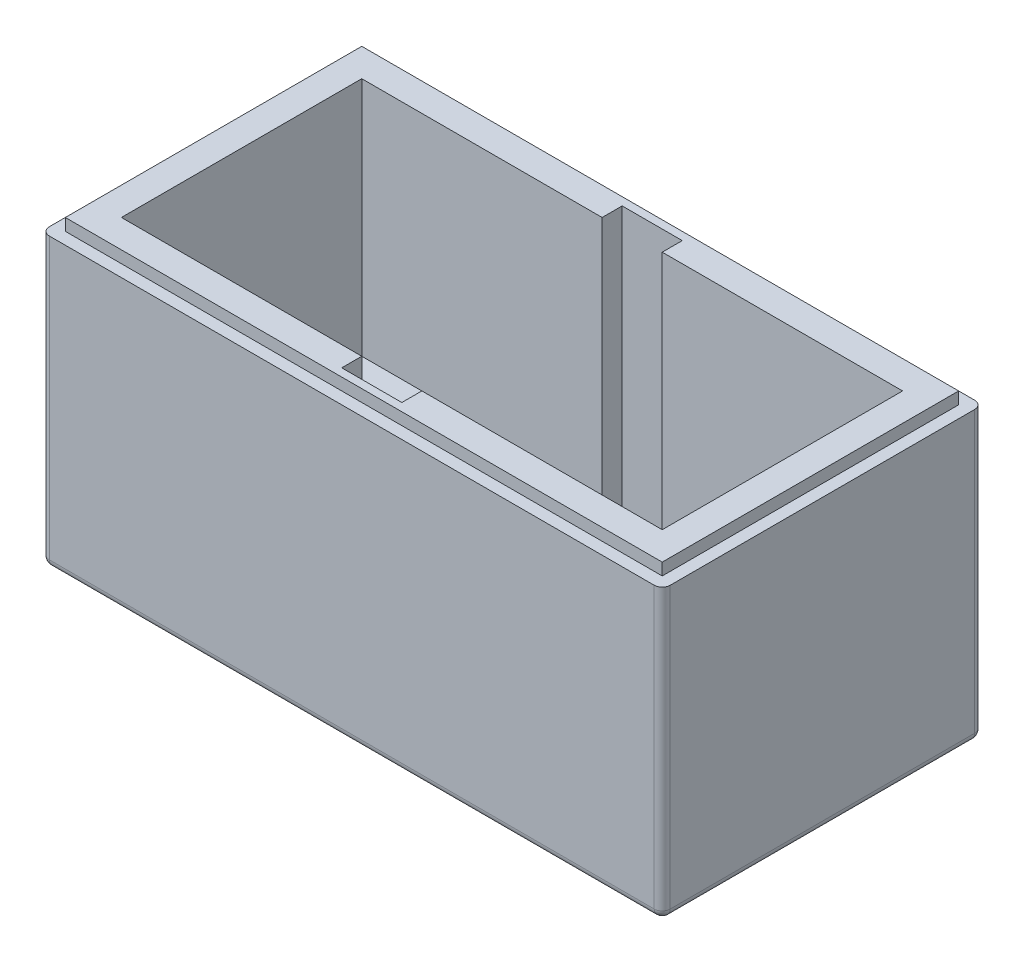
ISO-10303-21;
HEADER;
FILE_DESCRIPTION(('STEP AP214'),'2;1');
FILE_NAME('part.step','',(''),(''),'','','');
FILE_SCHEMA(('AUTOMOTIVE_DESIGN { 1 0 10303 214 1 1 1 1 }'));
ENDSEC;
DATA;
#1=APPLICATION_CONTEXT('core data for automotive mechanical design processes');
#2=APPLICATION_PROTOCOL_DEFINITION('international standard','automotive_design',2000,#1);
#3=PRODUCT_CONTEXT('',#1,'mechanical');
#4=PRODUCT('Part','Part','',(#3));
#5=PRODUCT_RELATED_PRODUCT_CATEGORY('part','',(#4));
#6=PRODUCT_DEFINITION_FORMATION('','',#4);
#7=PRODUCT_DEFINITION_CONTEXT('part definition',#1,'design');
#8=PRODUCT_DEFINITION('design','',#6,#7);
#9=PRODUCT_DEFINITION_SHAPE('','',#8);
#10=(LENGTH_UNIT() NAMED_UNIT(*) SI_UNIT(.MILLI.,.METRE.));
#11=(NAMED_UNIT(*) PLANE_ANGLE_UNIT() SI_UNIT($,.RADIAN.));
#12=(NAMED_UNIT(*) SI_UNIT($,.STERADIAN.) SOLID_ANGLE_UNIT());
#13=UNCERTAINTY_MEASURE_WITH_UNIT(LENGTH_MEASURE(1.E-05),#10,'distance_accuracy_value','');
#14=(GEOMETRIC_REPRESENTATION_CONTEXT(3) GLOBAL_UNCERTAINTY_ASSIGNED_CONTEXT((#13)) GLOBAL_UNIT_ASSIGNED_CONTEXT((#10,
#11,#12)) REPRESENTATION_CONTEXT('',''));
#15=CARTESIAN_POINT('',(0.,0.,0.));
#16=DIRECTION('',(0.,0.,1.));
#17=DIRECTION('',(1.,0.,0.));
#18=AXIS2_PLACEMENT_3D('',#15,#16,#17);
#19=CARTESIAN_POINT('',(0.,75.,0.));
#20=DIRECTION('',(0.,1.,0.));
#21=DIRECTION('',(0.,0.,1.));
#22=AXIS2_PLACEMENT_3D('',#19,#20,#21);
#23=PLANE('',#22);
#24=DIRECTION('',(0.,0.,1.));
#25=VECTOR('',#24,1.);
#26=CARTESIAN_POINT('',(-145.,75.,10.));
#27=LINE('',#26,#25);
#28=CARTESIAN_POINT('',(-145.,75.,10.));
#29=VERTEX_POINT('',#28);
#30=CARTESIAN_POINT('',(-145.,75.,70.));
#31=VERTEX_POINT('',#30);
#32=EDGE_CURVE('E267',#29,#31,#27,.T.);
#33=ORIENTED_EDGE('',*,*,#32,.F.);
#34=DIRECTION('',(-1.,0.,0.));
#35=VECTOR('',#34,1.);
#36=CARTESIAN_POINT('',(-145.,75.,10.));
#37=LINE('',#36,#35);
#38=CARTESIAN_POINT('',(-85.,75.,10.));
#39=VERTEX_POINT('',#38);
#40=EDGE_CURVE('E265',#39,#29,#37,.T.);
#41=ORIENTED_EDGE('',*,*,#40,.F.);
#42=DIRECTION('',(0.,0.,1.));
#43=VECTOR('',#42,1.);
#44=CARTESIAN_POINT('',(-85.,75.,10.));
#45=LINE('',#44,#43);
#46=CARTESIAN_POINT('',(-85.,75.,5.00000000000001));
#47=VERTEX_POINT('',#46);
#48=EDGE_CURVE('E292',#47,#39,#45,.T.);
#49=ORIENTED_EDGE('',*,*,#48,.F.);
#50=DIRECTION('',(-1.,0.,0.));
#51=VECTOR('',#50,1.);
#52=CARTESIAN_POINT('',(-85.,75.,5.00000000000001));
#53=LINE('',#52,#51);
#54=CARTESIAN_POINT('',(-70.,75.,5.00000000000001));
#55=VERTEX_POINT('',#54);
#56=EDGE_CURVE('E289',#55,#47,#53,.T.);
#57=ORIENTED_EDGE('',*,*,#56,.F.);
#58=DIRECTION('',(0.,0.,-1.));
#59=VECTOR('',#58,1.);
#60=CARTESIAN_POINT('',(-70.,75.,5.00000000000001));
#61=LINE('',#60,#59);
#62=CARTESIAN_POINT('',(-70.,75.,9.99999999999999));
#63=VERTEX_POINT('',#62);
#64=EDGE_CURVE('E286',#63,#55,#61,.T.);
#65=ORIENTED_EDGE('',*,*,#64,.F.);
#66=DIRECTION('',(-1.,0.,0.));
#67=VECTOR('',#66,1.);
#68=CARTESIAN_POINT('',(-70.,75.,9.99999999999999));
#69=LINE('',#68,#67);
#70=CARTESIAN_POINT('',(-9.99999999999999,75.,10.));
#71=VERTEX_POINT('',#70);
#72=EDGE_CURVE('E284',#71,#63,#69,.T.);
#73=ORIENTED_EDGE('',*,*,#72,.F.);
#74=DIRECTION('',(0.,0.,-1.));
#75=VECTOR('',#74,1.);
#76=CARTESIAN_POINT('',(-9.99999999999999,75.,10.));
#77=LINE('',#76,#75);
#78=CARTESIAN_POINT('',(-9.99999999999999,75.,70.));
#79=VERTEX_POINT('',#78);
#80=EDGE_CURVE('E282',#79,#71,#77,.T.);
#81=ORIENTED_EDGE('',*,*,#80,.F.);
#82=DIRECTION('',(1.,0.,0.));
#83=VECTOR('',#82,1.);
#84=CARTESIAN_POINT('',(-9.99999999999999,75.,70.));
#85=LINE('',#84,#83);
#86=CARTESIAN_POINT('',(-70.,75.,70.));
#87=VERTEX_POINT('',#86);
#88=EDGE_CURVE('E280',#87,#79,#85,.T.);
#89=ORIENTED_EDGE('',*,*,#88,.F.);
#90=DIRECTION('',(0.,0.,-1.));
#91=VECTOR('',#90,1.);
#92=CARTESIAN_POINT('',(-70.,75.,70.));
#93=LINE('',#92,#91);
#94=CARTESIAN_POINT('',(-70.,75.,75.));
#95=VERTEX_POINT('',#94);
#96=EDGE_CURVE('E278',#95,#87,#93,.T.);
#97=ORIENTED_EDGE('',*,*,#96,.F.);
#98=DIRECTION('',(1.,0.,0.));
#99=VECTOR('',#98,1.);
#100=CARTESIAN_POINT('',(-85.,75.,75.));
#101=LINE('',#100,#99);
#102=CARTESIAN_POINT('',(-85.,75.,75.));
#103=VERTEX_POINT('',#102);
#104=EDGE_CURVE('E275',#103,#95,#101,.T.);
#105=ORIENTED_EDGE('',*,*,#104,.F.);
#106=DIRECTION('',(0.,0.,1.));
#107=VECTOR('',#106,1.);
#108=CARTESIAN_POINT('',(-85.,75.,70.));
#109=LINE('',#108,#107);
#110=CARTESIAN_POINT('',(-85.,75.,70.));
#111=VERTEX_POINT('',#110);
#112=EDGE_CURVE('E272',#111,#103,#109,.T.);
#113=ORIENTED_EDGE('',*,*,#112,.F.);
#114=DIRECTION('',(1.,0.,0.));
#115=VECTOR('',#114,1.);
#116=CARTESIAN_POINT('',(-145.,75.,70.));
#117=LINE('',#116,#115);
#118=EDGE_CURVE('E270',#31,#111,#117,.T.);
#119=ORIENTED_EDGE('',*,*,#118,.F.);
#120=EDGE_LOOP('',(#33,#41,#49,#57,#65,#73,#81,#89,#97,#105,#113,#119));
#121=FACE_BOUND('',#120,.T.);
#122=DIRECTION('',(-1.,0.,0.));
#123=VECTOR('',#122,1.);
#124=CARTESIAN_POINT('',(-152.,75.,3.));
#125=LINE('',#124,#123);
#126=CARTESIAN_POINT('',(-3.,75.,3.));
#127=VERTEX_POINT('',#126);
#128=CARTESIAN_POINT('',(-152.,75.,3.));
#129=VERTEX_POINT('',#128);
#130=EDGE_CURVE('E235',#127,#129,#125,.T.);
#131=ORIENTED_EDGE('',*,*,#130,.T.);
#132=DIRECTION('',(0.,0.,1.));
#133=VECTOR('',#132,1.);
#134=CARTESIAN_POINT('',(-152.,75.,3.));
#135=LINE('',#134,#133);
#136=CARTESIAN_POINT('',(-152.,75.,77.));
#137=VERTEX_POINT('',#136);
#138=EDGE_CURVE('E243',#129,#137,#135,.T.);
#139=ORIENTED_EDGE('',*,*,#138,.T.);
#140=DIRECTION('',(1.,0.,0.));
#141=VECTOR('',#140,1.);
#142=CARTESIAN_POINT('',(-152.,75.,77.));
#143=LINE('',#142,#141);
#144=CARTESIAN_POINT('',(-3.,75.,77.));
#145=VERTEX_POINT('',#144);
#146=EDGE_CURVE('E214',#137,#145,#143,.T.);
#147=ORIENTED_EDGE('',*,*,#146,.T.);
#148=DIRECTION('',(0.,0.,-1.));
#149=VECTOR('',#148,1.);
#150=CARTESIAN_POINT('',(-3.,75.,3.));
#151=LINE('',#150,#149);
#152=EDGE_CURVE('E238',#145,#127,#151,.T.);
#153=ORIENTED_EDGE('',*,*,#152,.T.);
#154=EDGE_LOOP('',(#131,#139,#147,#153));
#155=FACE_BOUND('',#154,.T.);
#156=ADVANCED_FACE('F36',(#121,#155),#23,.T.);
#157=CARTESIAN_POINT('',(0.,15.,0.));
#158=DIRECTION('',(0.,-1.,0.));
#159=DIRECTION('',(0.,0.,-1.));
#160=AXIS2_PLACEMENT_3D('',#157,#158,#159);
#161=PLANE('',#160);
#162=DIRECTION('',(0.,0.,1.));
#163=VECTOR('',#162,1.);
#164=CARTESIAN_POINT('',(-85.,15.,5.00000000000001));
#165=LINE('',#164,#163);
#166=CARTESIAN_POINT('',(-85.,15.,10.));
#167=VERTEX_POINT('',#166);
#168=CARTESIAN_POINT('',(-85.,15.,70.));
#169=VERTEX_POINT('',#168);
#170=EDGE_CURVE('E328',#167,#169,#165,.T.);
#171=ORIENTED_EDGE('',*,*,#170,.F.);
#172=DIRECTION('',(-1.,0.,0.));
#173=VECTOR('',#172,1.);
#174=CARTESIAN_POINT('',(-145.,15.,10.));
#175=LINE('',#174,#173);
#176=CARTESIAN_POINT('',(-145.,15.,10.));
#177=VERTEX_POINT('',#176);
#178=EDGE_CURVE('E264',#167,#177,#175,.T.);
#179=ORIENTED_EDGE('',*,*,#178,.T.);
#180=DIRECTION('',(0.,0.,1.));
#181=VECTOR('',#180,1.);
#182=CARTESIAN_POINT('',(-145.,15.,10.));
#183=LINE('',#182,#181);
#184=CARTESIAN_POINT('',(-145.,15.,70.));
#185=VERTEX_POINT('',#184);
#186=EDGE_CURVE('E297',#177,#185,#183,.T.);
#187=ORIENTED_EDGE('',*,*,#186,.T.);
#188=DIRECTION('',(1.,0.,0.));
#189=VECTOR('',#188,1.);
#190=CARTESIAN_POINT('',(-145.,15.,70.));
#191=LINE('',#190,#189);
#192=EDGE_CURVE('E300',#185,#169,#191,.T.);
#193=ORIENTED_EDGE('',*,*,#192,.T.);
#194=EDGE_LOOP('',(#171,#179,#187,#193));
#195=FACE_BOUND('',#194,.T.);
#196=ADVANCED_FACE('F496',(#195),#161,.F.);
#197=DIRECTION('',(0.,0.,-1.));
#198=VECTOR('',#197,1.);
#199=CARTESIAN_POINT('',(-70.,15.,5.00000000000001));
#200=LINE('',#199,#198);
#201=CARTESIAN_POINT('',(-70.,15.,70.));
#202=VERTEX_POINT('',#201);
#203=CARTESIAN_POINT('',(-70.,15.,10.));
#204=VERTEX_POINT('',#203);
#205=EDGE_CURVE('E333',#202,#204,#200,.T.);
#206=ORIENTED_EDGE('',*,*,#205,.F.);
#207=DIRECTION('',(1.,0.,0.));
#208=VECTOR('',#207,1.);
#209=CARTESIAN_POINT('',(-9.99999999999999,15.,70.));
#210=LINE('',#209,#208);
#211=CARTESIAN_POINT('',(-9.99999999999999,15.,70.));
#212=VERTEX_POINT('',#211);
#213=EDGE_CURVE('E303',#202,#212,#210,.T.);
#214=ORIENTED_EDGE('',*,*,#213,.T.);
#215=DIRECTION('',(0.,0.,-1.));
#216=VECTOR('',#215,1.);
#217=CARTESIAN_POINT('',(-9.99999999999999,15.,10.));
#218=LINE('',#217,#216);
#219=CARTESIAN_POINT('',(-9.99999999999999,15.,10.));
#220=VERTEX_POINT('',#219);
#221=EDGE_CURVE('E306',#212,#220,#218,.T.);
#222=ORIENTED_EDGE('',*,*,#221,.T.);
#223=DIRECTION('',(-1.,0.,0.));
#224=VECTOR('',#223,1.);
#225=CARTESIAN_POINT('',(-70.,15.,9.99999999999999));
#226=LINE('',#225,#224);
#227=EDGE_CURVE('E268',#220,#204,#226,.T.);
#228=ORIENTED_EDGE('',*,*,#227,.T.);
#229=EDGE_LOOP('',(#206,#214,#222,#228));
#230=FACE_BOUND('',#229,.T.);
#231=ADVANCED_FACE('F502',(#230),#161,.F.);
#232=CARTESIAN_POINT('',(-85.,10.,5.00000000000001));
#233=DIRECTION('',(-1.,0.,0.));
#234=DIRECTION('',(0.,0.,1.));
#235=AXIS2_PLACEMENT_3D('',#232,#233,#234);
#236=PLANE('',#235);
#237=DIRECTION('',(0.,1.,0.));
#238=VECTOR('',#237,1.);
#239=CARTESIAN_POINT('',(-85.,10.,5.00000000000001));
#240=LINE('',#239,#238);
#241=CARTESIAN_POINT('',(-85.,10.,5.00000000000001));
#242=VERTEX_POINT('',#241);
#243=EDGE_CURVE('E347',#242,#47,#240,.T.);
#244=ORIENTED_EDGE('',*,*,#243,.T.);
#245=ORIENTED_EDGE('',*,*,#48,.T.);
#246=DIRECTION('',(0.,-1.,0.));
#247=VECTOR('',#246,1.);
#248=CARTESIAN_POINT('',(-85.,75.,10.));
#249=LINE('',#248,#247);
#250=EDGE_CURVE('E294',#39,#167,#249,.T.);
#251=ORIENTED_EDGE('',*,*,#250,.T.);
#252=ORIENTED_EDGE('',*,*,#170,.T.);
#253=DIRECTION('',(0.,-1.,0.));
#254=VECTOR('',#253,1.);
#255=CARTESIAN_POINT('',(-85.,75.,70.));
#256=LINE('',#255,#254);
#257=EDGE_CURVE('E321',#111,#169,#256,.T.);
#258=ORIENTED_EDGE('',*,*,#257,.F.);
#259=ORIENTED_EDGE('',*,*,#112,.T.);
#260=DIRECTION('',(0.,1.,0.));
#261=VECTOR('',#260,1.);
#262=CARTESIAN_POINT('',(-85.,10.,75.));
#263=LINE('',#262,#261);
#264=CARTESIAN_POINT('',(-85.,10.,75.));
#265=VERTEX_POINT('',#264);
#266=EDGE_CURVE('E342',#265,#103,#263,.T.);
#267=ORIENTED_EDGE('',*,*,#266,.F.);
#268=DIRECTION('',(0.,0.,1.));
#269=VECTOR('',#268,1.);
#270=CARTESIAN_POINT('',(-85.,10.,5.00000000000001));
#271=LINE('',#270,#269);
#272=EDGE_CURVE('E329',#242,#265,#271,.T.);
#273=ORIENTED_EDGE('',*,*,#272,.F.);
#274=EDGE_LOOP('',(#244,#245,#251,#252,#258,#259,#267,#273));
#275=FACE_BOUND('',#274,.T.);
#276=ADVANCED_FACE('F520',(#275),#236,.F.);
#277=CARTESIAN_POINT('',(-85.,10.,5.00000000000001));
#278=DIRECTION('',(0.,0.,-1.));
#279=DIRECTION('',(-1.,0.,0.));
#280=AXIS2_PLACEMENT_3D('',#277,#278,#279);
#281=PLANE('',#280);
#282=DIRECTION('',(0.,1.,0.));
#283=VECTOR('',#282,1.);
#284=CARTESIAN_POINT('',(-70.,10.,5.00000000000001));
#285=LINE('',#284,#283);
#286=CARTESIAN_POINT('',(-70.,10.,5.00000000000001));
#287=VERTEX_POINT('',#286);
#288=EDGE_CURVE('E350',#287,#55,#285,.T.);
#289=ORIENTED_EDGE('',*,*,#288,.T.);
#290=ORIENTED_EDGE('',*,*,#56,.T.);
#291=ORIENTED_EDGE('',*,*,#243,.F.);
#292=DIRECTION('',(-1.,0.,0.));
#293=VECTOR('',#292,1.);
#294=CARTESIAN_POINT('',(-85.,10.,5.00000000000001));
#295=LINE('',#294,#293);
#296=EDGE_CURVE('E339',#287,#242,#295,.T.);
#297=ORIENTED_EDGE('',*,*,#296,.F.);
#298=EDGE_LOOP('',(#289,#290,#291,#297));
#299=FACE_BOUND('',#298,.T.);
#300=ADVANCED_FACE('F516',(#299),#281,.F.);
#301=CARTESIAN_POINT('',(-70.,10.,5.00000000000001));
#302=DIRECTION('',(1.,0.,0.));
#303=DIRECTION('',(0.,0.,-1.));
#304=AXIS2_PLACEMENT_3D('',#301,#302,#303);
#305=PLANE('',#304);
#306=DIRECTION('',(0.,1.,0.));
#307=VECTOR('',#306,1.);
#308=CARTESIAN_POINT('',(-70.,10.,75.));
#309=LINE('',#308,#307);
#310=CARTESIAN_POINT('',(-70.,10.,75.));
#311=VERTEX_POINT('',#310);
#312=EDGE_CURVE('E352',#311,#95,#309,.T.);
#313=ORIENTED_EDGE('',*,*,#312,.T.);
#314=ORIENTED_EDGE('',*,*,#96,.T.);
#315=DIRECTION('',(0.,-1.,0.));
#316=VECTOR('',#315,1.);
#317=CARTESIAN_POINT('',(-70.,75.,70.));
#318=LINE('',#317,#316);
#319=EDGE_CURVE('E319',#87,#202,#318,.T.);
#320=ORIENTED_EDGE('',*,*,#319,.T.);
#321=ORIENTED_EDGE('',*,*,#205,.T.);
#322=DIRECTION('',(0.,-1.,0.));
#323=VECTOR('',#322,1.);
#324=CARTESIAN_POINT('',(-70.,75.,9.99999999999999));
#325=LINE('',#324,#323);
#326=EDGE_CURVE('E313',#63,#204,#325,.T.);
#327=ORIENTED_EDGE('',*,*,#326,.F.);
#328=ORIENTED_EDGE('',*,*,#64,.T.);
#329=ORIENTED_EDGE('',*,*,#288,.F.);
#330=DIRECTION('',(0.,0.,-1.));
#331=VECTOR('',#330,1.);
#332=CARTESIAN_POINT('',(-70.,10.,5.00000000000001));
#333=LINE('',#332,#331);
#334=EDGE_CURVE('E336',#311,#287,#333,.T.);
#335=ORIENTED_EDGE('',*,*,#334,.F.);
#336=EDGE_LOOP('',(#313,#314,#320,#321,#327,#328,#329,#335));
#337=FACE_BOUND('',#336,.T.);
#338=ADVANCED_FACE('F519',(#337),#305,.F.);
#339=CARTESIAN_POINT('',(-85.,10.,75.));
#340=DIRECTION('',(0.,0.,1.));
#341=DIRECTION('',(1.,0.,0.));
#342=AXIS2_PLACEMENT_3D('',#339,#340,#341);
#343=PLANE('',#342);
#344=ORIENTED_EDGE('',*,*,#266,.T.);
#345=ORIENTED_EDGE('',*,*,#104,.T.);
#346=ORIENTED_EDGE('',*,*,#312,.F.);
#347=DIRECTION('',(1.,0.,0.));
#348=VECTOR('',#347,1.);
#349=CARTESIAN_POINT('',(-85.,10.,75.));
#350=LINE('',#349,#348);
#351=EDGE_CURVE('E332',#265,#311,#350,.T.);
#352=ORIENTED_EDGE('',*,*,#351,.F.);
#353=EDGE_LOOP('',(#344,#345,#346,#352));
#354=FACE_BOUND('',#353,.T.);
#355=ADVANCED_FACE('F514',(#354),#343,.F.);
#356=CARTESIAN_POINT('',(0.,10.,0.));
#357=DIRECTION('',(0.,1.,0.));
#358=DIRECTION('',(0.,0.,1.));
#359=AXIS2_PLACEMENT_3D('',#356,#357,#358);
#360=PLANE('',#359);
#361=ORIENTED_EDGE('',*,*,#272,.T.);
#362=ORIENTED_EDGE('',*,*,#351,.T.);
#363=ORIENTED_EDGE('',*,*,#334,.T.);
#364=ORIENTED_EDGE('',*,*,#296,.T.);
#365=EDGE_LOOP('',(#361,#362,#363,#364));
#366=FACE_BOUND('',#365,.T.);
#367=ADVANCED_FACE('F511',(#366),#360,.T.);
#368=CARTESIAN_POINT('',(-145.,75.,10.));
#369=DIRECTION('',(0.,0.,1.));
#370=DIRECTION('',(1.,0.,0.));
#371=AXIS2_PLACEMENT_3D('',#368,#369,#370);
#372=PLANE('',#371);
#373=ORIENTED_EDGE('',*,*,#178,.F.);
#374=ORIENTED_EDGE('',*,*,#250,.F.);
#375=ORIENTED_EDGE('',*,*,#40,.T.);
#376=DIRECTION('',(0.,-1.,0.));
#377=VECTOR('',#376,1.);
#378=CARTESIAN_POINT('',(-145.,75.,10.));
#379=LINE('',#378,#377);
#380=EDGE_CURVE('E325',#29,#177,#379,.T.);
#381=ORIENTED_EDGE('',*,*,#380,.T.);
#382=EDGE_LOOP('',(#373,#374,#375,#381));
#383=FACE_BOUND('',#382,.T.);
#384=ADVANCED_FACE('F509',(#383),#372,.T.);
#385=CARTESIAN_POINT('',(-145.,75.,10.));
#386=DIRECTION('',(1.,0.,0.));
#387=DIRECTION('',(0.,0.,-1.));
#388=AXIS2_PLACEMENT_3D('',#385,#386,#387);
#389=PLANE('',#388);
#390=ORIENTED_EDGE('',*,*,#186,.F.);
#391=ORIENTED_EDGE('',*,*,#380,.F.);
#392=ORIENTED_EDGE('',*,*,#32,.T.);
#393=DIRECTION('',(0.,-1.,0.));
#394=VECTOR('',#393,1.);
#395=CARTESIAN_POINT('',(-145.,75.,70.));
#396=LINE('',#395,#394);
#397=EDGE_CURVE('E323',#31,#185,#396,.T.);
#398=ORIENTED_EDGE('',*,*,#397,.T.);
#399=EDGE_LOOP('',(#390,#391,#392,#398));
#400=FACE_BOUND('',#399,.T.);
#401=ADVANCED_FACE('F746',(#400),#389,.T.);
#402=CARTESIAN_POINT('',(-145.,75.,70.));
#403=DIRECTION('',(0.,0.,-1.));
#404=DIRECTION('',(-1.,0.,0.));
#405=AXIS2_PLACEMENT_3D('',#402,#403,#404);
#406=PLANE('',#405);
#407=ORIENTED_EDGE('',*,*,#192,.F.);
#408=ORIENTED_EDGE('',*,*,#397,.F.);
#409=ORIENTED_EDGE('',*,*,#118,.T.);
#410=ORIENTED_EDGE('',*,*,#257,.T.);
#411=EDGE_LOOP('',(#407,#408,#409,#410));
#412=FACE_BOUND('',#411,.T.);
#413=ADVANCED_FACE('F738',(#412),#406,.T.);
#414=CARTESIAN_POINT('',(-9.99999999999999,75.,70.));
#415=DIRECTION('',(0.,0.,-1.));
#416=DIRECTION('',(-1.,0.,0.));
#417=AXIS2_PLACEMENT_3D('',#414,#415,#416);
#418=PLANE('',#417);
#419=ORIENTED_EDGE('',*,*,#213,.F.);
#420=ORIENTED_EDGE('',*,*,#319,.F.);
#421=ORIENTED_EDGE('',*,*,#88,.T.);
#422=DIRECTION('',(0.,-1.,0.));
#423=VECTOR('',#422,1.);
#424=CARTESIAN_POINT('',(-9.99999999999999,75.,70.));
#425=LINE('',#424,#423);
#426=EDGE_CURVE('E317',#79,#212,#425,.T.);
#427=ORIENTED_EDGE('',*,*,#426,.T.);
#428=EDGE_LOOP('',(#419,#420,#421,#427));
#429=FACE_BOUND('',#428,.T.);
#430=ADVANCED_FACE('F730',(#429),#418,.T.);
#431=CARTESIAN_POINT('',(-9.99999999999999,75.,10.));
#432=DIRECTION('',(-1.,0.,0.));
#433=DIRECTION('',(0.,0.,1.));
#434=AXIS2_PLACEMENT_3D('',#431,#432,#433);
#435=PLANE('',#434);
#436=ORIENTED_EDGE('',*,*,#221,.F.);
#437=ORIENTED_EDGE('',*,*,#426,.F.);
#438=ORIENTED_EDGE('',*,*,#80,.T.);
#439=DIRECTION('',(0.,-1.,0.));
#440=VECTOR('',#439,1.);
#441=CARTESIAN_POINT('',(-9.99999999999999,75.,10.));
#442=LINE('',#441,#440);
#443=EDGE_CURVE('E315',#71,#220,#442,.T.);
#444=ORIENTED_EDGE('',*,*,#443,.T.);
#445=EDGE_LOOP('',(#436,#437,#438,#444));
#446=FACE_BOUND('',#445,.T.);
#447=ADVANCED_FACE('F722',(#446),#435,.T.);
#448=CARTESIAN_POINT('',(-70.,75.,9.99999999999999));
#449=DIRECTION('',(0.,0.,1.));
#450=DIRECTION('',(1.,0.,0.));
#451=AXIS2_PLACEMENT_3D('',#448,#449,#450);
#452=PLANE('',#451);
#453=ORIENTED_EDGE('',*,*,#227,.F.);
#454=ORIENTED_EDGE('',*,*,#443,.F.);
#455=ORIENTED_EDGE('',*,*,#72,.T.);
#456=ORIENTED_EDGE('',*,*,#326,.T.);
#457=EDGE_LOOP('',(#453,#454,#455,#456));
#458=FACE_BOUND('',#457,.T.);
#459=ADVANCED_FACE('F677',(#458),#452,.T.);
#460=CARTESIAN_POINT('',(0.,72.,0.));
#461=DIRECTION('',(0.,1.,0.));
#462=DIRECTION('',(0.,0.,1.));
#463=AXIS2_PLACEMENT_3D('',#460,#461,#462);
#464=PLANE('',#463);
#465=DIRECTION('',(-1.,0.,0.));
#466=VECTOR('',#465,1.);
#467=CARTESIAN_POINT('',(-152.,72.,3.));
#468=LINE('',#467,#466);
#469=CARTESIAN_POINT('',(-3.,72.,3.));
#470=VERTEX_POINT('',#469);
#471=CARTESIAN_POINT('',(-152.,72.,3.));
#472=VERTEX_POINT('',#471);
#473=EDGE_CURVE('E220',#470,#472,#468,.T.);
#474=ORIENTED_EDGE('',*,*,#473,.F.);
#475=DIRECTION('',(0.,0.,-1.));
#476=VECTOR('',#475,1.);
#477=CARTESIAN_POINT('',(-3.,72.,3.));
#478=LINE('',#477,#476);
#479=CARTESIAN_POINT('',(-3.,72.,77.));
#480=VERTEX_POINT('',#479);
#481=EDGE_CURVE('E230',#480,#470,#478,.T.);
#482=ORIENTED_EDGE('',*,*,#481,.F.);
#483=DIRECTION('',(1.,0.,0.));
#484=VECTOR('',#483,1.);
#485=CARTESIAN_POINT('',(-152.,72.,77.));
#486=LINE('',#485,#484);
#487=CARTESIAN_POINT('',(-152.,72.,77.));
#488=VERTEX_POINT('',#487);
#489=EDGE_CURVE('E212',#488,#480,#486,.T.);
#490=ORIENTED_EDGE('',*,*,#489,.F.);
#491=DIRECTION('',(0.,0.,1.));
#492=VECTOR('',#491,1.);
#493=CARTESIAN_POINT('',(-152.,72.,3.));
#494=LINE('',#493,#492);
#495=EDGE_CURVE('E227',#472,#488,#494,.T.);
#496=ORIENTED_EDGE('',*,*,#495,.F.);
#497=EDGE_LOOP('',(#474,#482,#490,#496));
#498=FACE_BOUND('',#497,.T.);
#499=DIRECTION('',(1.,0.,0.));
#500=VECTOR('',#499,1.);
#501=CARTESIAN_POINT('',(-155.,72.,80.));
#502=LINE('',#501,#500);
#503=CARTESIAN_POINT('',(-153.,72.,80.));
#504=VERTEX_POINT('',#503);
#505=CARTESIAN_POINT('',(-2.,72.,80.));
#506=VERTEX_POINT('',#505);
#507=EDGE_CURVE('E255',#504,#506,#502,.T.);
#508=ORIENTED_EDGE('',*,*,#507,.T.);
#509=CARTESIAN_POINT('',(-2.,72.,78.));
#510=DIRECTION('',(0.,1.,0.));
#511=DIRECTION('',(0.,0.,1.));
#512=AXIS2_PLACEMENT_3D('',#509,#510,#511);
#513=CIRCLE('',#512,2.);
#514=CARTESIAN_POINT('',(0.,72.,78.));
#515=VERTEX_POINT('',#514);
#516=EDGE_CURVE('E382',#506,#515,#513,.T.);
#517=ORIENTED_EDGE('',*,*,#516,.T.);
#518=DIRECTION('',(0.,0.,-1.));
#519=VECTOR('',#518,1.);
#520=CARTESIAN_POINT('',(0.,72.,0.));
#521=LINE('',#520,#519);
#522=CARTESIAN_POINT('',(0.,72.,2.));
#523=VERTEX_POINT('',#522);
#524=EDGE_CURVE('E258',#515,#523,#521,.T.);
#525=ORIENTED_EDGE('',*,*,#524,.T.);
#526=CARTESIAN_POINT('',(-2.,72.,2.));
#527=DIRECTION('',(0.,1.,0.));
#528=DIRECTION('',(0.,0.,1.));
#529=AXIS2_PLACEMENT_3D('',#526,#527,#528);
#530=CIRCLE('',#529,2.);
#531=CARTESIAN_POINT('',(-2.,72.,0.));
#532=VERTEX_POINT('',#531);
#533=EDGE_CURVE('E380',#523,#532,#530,.T.);
#534=ORIENTED_EDGE('',*,*,#533,.T.);
#535=DIRECTION('',(-1.,0.,0.));
#536=VECTOR('',#535,1.);
#537=CARTESIAN_POINT('',(-155.,72.,0.));
#538=LINE('',#537,#536);
#539=CARTESIAN_POINT('',(-153.,72.,0.));
#540=VERTEX_POINT('',#539);
#541=EDGE_CURVE('E261',#532,#540,#538,.T.);
#542=ORIENTED_EDGE('',*,*,#541,.T.);
#543=CARTESIAN_POINT('',(-153.,72.,2.00000000000002));
#544=DIRECTION('',(0.,1.,0.));
#545=DIRECTION('',(0.,0.,1.));
#546=AXIS2_PLACEMENT_3D('',#543,#544,#545);
#547=CIRCLE('',#546,2.);
#548=CARTESIAN_POINT('',(-155.,72.,2.00000000000002));
#549=VERTEX_POINT('',#548);
#550=EDGE_CURVE('E378',#540,#549,#547,.T.);
#551=ORIENTED_EDGE('',*,*,#550,.T.);
#552=DIRECTION('',(0.,0.,1.));
#553=VECTOR('',#552,1.);
#554=CARTESIAN_POINT('',(-155.,72.,0.));
#555=LINE('',#554,#553);
#556=CARTESIAN_POINT('',(-155.,72.,78.));
#557=VERTEX_POINT('',#556);
#558=EDGE_CURVE('E249',#549,#557,#555,.T.);
#559=ORIENTED_EDGE('',*,*,#558,.T.);
#560=CARTESIAN_POINT('',(-153.,72.,78.));
#561=DIRECTION('',(0.,1.,0.));
#562=DIRECTION('',(0.,0.,1.));
#563=AXIS2_PLACEMENT_3D('',#560,#561,#562);
#564=CIRCLE('',#563,2.);
#565=EDGE_CURVE('E376',#557,#504,#564,.T.);
#566=ORIENTED_EDGE('',*,*,#565,.T.);
#567=EDGE_LOOP('',(#508,#517,#525,#534,#542,#551,#559,#566));
#568=FACE_BOUND('',#567,.T.);
#569=ADVANCED_FACE('F225',(#498,#568),#464,.T.);
#570=CARTESIAN_POINT('',(-152.,72.,3.));
#571=DIRECTION('',(-1.,0.,0.));
#572=DIRECTION('',(0.,0.,1.));
#573=AXIS2_PLACEMENT_3D('',#570,#571,#572);
#574=PLANE('',#573);
#575=ORIENTED_EDGE('',*,*,#138,.F.);
#576=DIRECTION('',(0.,1.,0.));
#577=VECTOR('',#576,1.);
#578=CARTESIAN_POINT('',(-152.,72.,3.));
#579=LINE('',#578,#577);
#580=EDGE_CURVE('E234',#472,#129,#579,.T.);
#581=ORIENTED_EDGE('',*,*,#580,.F.);
#582=ORIENTED_EDGE('',*,*,#495,.T.);
#583=DIRECTION('',(0.,1.,0.));
#584=VECTOR('',#583,1.);
#585=CARTESIAN_POINT('',(-152.,72.,77.));
#586=LINE('',#585,#584);
#587=EDGE_CURVE('E208',#488,#137,#586,.T.);
#588=ORIENTED_EDGE('',*,*,#587,.T.);
#589=EDGE_LOOP('',(#575,#581,#582,#588));
#590=FACE_BOUND('',#589,.T.);
#591=ADVANCED_FACE('F233',(#590),#574,.T.);
#592=CARTESIAN_POINT('',(-152.,72.,3.));
#593=DIRECTION('',(0.,0.,-1.));
#594=DIRECTION('',(-1.,0.,0.));
#595=AXIS2_PLACEMENT_3D('',#592,#593,#594);
#596=PLANE('',#595);
#597=ORIENTED_EDGE('',*,*,#130,.F.);
#598=DIRECTION('',(0.,1.,0.));
#599=VECTOR('',#598,1.);
#600=CARTESIAN_POINT('',(-3.,72.,3.));
#601=LINE('',#600,#599);
#602=EDGE_CURVE('E250',#470,#127,#601,.T.);
#603=ORIENTED_EDGE('',*,*,#602,.F.);
#604=ORIENTED_EDGE('',*,*,#473,.T.);
#605=ORIENTED_EDGE('',*,*,#580,.T.);
#606=EDGE_LOOP('',(#597,#603,#604,#605));
#607=FACE_BOUND('',#606,.T.);
#608=ADVANCED_FACE('F654',(#607),#596,.T.);
#609=CARTESIAN_POINT('',(-3.,72.,3.));
#610=DIRECTION('',(1.,0.,0.));
#611=DIRECTION('',(0.,0.,-1.));
#612=AXIS2_PLACEMENT_3D('',#609,#610,#611);
#613=PLANE('',#612);
#614=ORIENTED_EDGE('',*,*,#152,.F.);
#615=DIRECTION('',(0.,1.,0.));
#616=VECTOR('',#615,1.);
#617=CARTESIAN_POINT('',(-3.,72.,77.));
#618=LINE('',#617,#616);
#619=EDGE_CURVE('E219',#480,#145,#618,.T.);
#620=ORIENTED_EDGE('',*,*,#619,.F.);
#621=ORIENTED_EDGE('',*,*,#481,.T.);
#622=ORIENTED_EDGE('',*,*,#602,.T.);
#623=EDGE_LOOP('',(#614,#620,#621,#622));
#624=FACE_BOUND('',#623,.T.);
#625=ADVANCED_FACE('F645',(#624),#613,.T.);
#626=CARTESIAN_POINT('',(-152.,72.,77.));
#627=DIRECTION('',(0.,0.,1.));
#628=DIRECTION('',(1.,0.,0.));
#629=AXIS2_PLACEMENT_3D('',#626,#627,#628);
#630=PLANE('',#629);
#631=ORIENTED_EDGE('',*,*,#146,.F.);
#632=ORIENTED_EDGE('',*,*,#587,.F.);
#633=ORIENTED_EDGE('',*,*,#489,.T.);
#634=ORIENTED_EDGE('',*,*,#619,.T.);
#635=EDGE_LOOP('',(#631,#632,#633,#634));
#636=FACE_BOUND('',#635,.T.);
#637=ADVANCED_FACE('F210',(#636),#630,.T.);
#638=CARTESIAN_POINT('',(0.,0.,0.));
#639=DIRECTION('',(0.,-1.,0.));
#640=DIRECTION('',(0.,0.,-1.));
#641=AXIS2_PLACEMENT_3D('',#638,#639,#640);
#642=PLANE('',#641);
#643=DIRECTION('',(0.,0.,-1.));
#644=VECTOR('',#643,1.);
#645=CARTESIAN_POINT('',(-2.,0.,80.));
#646=LINE('',#645,#644);
#647=CARTESIAN_POINT('',(-2.,0.,2.));
#648=VERTEX_POINT('',#647);
#649=CARTESIAN_POINT('',(-2.,0.,78.));
#650=VERTEX_POINT('',#649);
#651=EDGE_CURVE('E365',#648,#650,#646,.F.);
#652=ORIENTED_EDGE('',*,*,#651,.T.);
#653=DIRECTION('',(1.,0.,0.));
#654=VECTOR('',#653,1.);
#655=CARTESIAN_POINT('',(-155.,0.,78.));
#656=LINE('',#655,#654);
#657=CARTESIAN_POINT('',(-153.,0.,78.));
#658=VERTEX_POINT('',#657);
#659=EDGE_CURVE('E367',#650,#658,#656,.F.);
#660=ORIENTED_EDGE('',*,*,#659,.T.);
#661=DIRECTION('',(0.,0.,1.));
#662=VECTOR('',#661,1.);
#663=CARTESIAN_POINT('',(-153.,0.,0.));
#664=LINE('',#663,#662);
#665=CARTESIAN_POINT('',(-153.,0.,2.00000000000002));
#666=VERTEX_POINT('',#665);
#667=EDGE_CURVE('E361',#658,#666,#664,.F.);
#668=ORIENTED_EDGE('',*,*,#667,.T.);
#669=DIRECTION('',(-1.,0.,0.));
#670=VECTOR('',#669,1.);
#671=CARTESIAN_POINT('',(0.,0.,2.));
#672=LINE('',#671,#670);
#673=EDGE_CURVE('E363',#666,#648,#672,.F.);
#674=ORIENTED_EDGE('',*,*,#673,.T.);
#675=EDGE_LOOP('',(#652,#660,#668,#674));
#676=FACE_BOUND('',#675,.T.);
#677=ADVANCED_FACE('F469',(#676),#642,.T.);
#678=CARTESIAN_POINT('',(0.,15.,0.));
#679=DIRECTION('',(-1.,0.,0.));
#680=DIRECTION('',(0.,0.,1.));
#681=AXIS2_PLACEMENT_3D('',#678,#679,#680);
#682=PLANE('',#681);
#683=ORIENTED_EDGE('',*,*,#524,.F.);
#684=DIRECTION('',(0.,-1.,0.));
#685=VECTOR('',#684,1.);
#686=CARTESIAN_POINT('',(0.,15.,78.));
#687=LINE('',#686,#685);
#688=CARTESIAN_POINT('',(0.,2.,78.));
#689=VERTEX_POINT('',#688);
#690=EDGE_CURVE('E374',#515,#689,#687,.T.);
#691=ORIENTED_EDGE('',*,*,#690,.T.);
#692=DIRECTION('',(0.,0.,-1.));
#693=VECTOR('',#692,1.);
#694=CARTESIAN_POINT('',(0.,2.,0.));
#695=LINE('',#694,#693);
#696=CARTESIAN_POINT('',(0.,2.,2.));
#697=VERTEX_POINT('',#696);
#698=EDGE_CURVE('E372',#689,#697,#695,.T.);
#699=ORIENTED_EDGE('',*,*,#698,.T.);
#700=DIRECTION('',(0.,-1.,0.));
#701=VECTOR('',#700,1.);
#702=CARTESIAN_POINT('',(0.,15.,2.));
#703=LINE('',#702,#701);
#704=EDGE_CURVE('E370',#697,#523,#703,.F.);
#705=ORIENTED_EDGE('',*,*,#704,.T.);
#706=EDGE_LOOP('',(#683,#691,#699,#705));
#707=FACE_BOUND('',#706,.T.);
#708=ADVANCED_FACE('F485',(#707),#682,.F.);
#709=CARTESIAN_POINT('',(0.,15.,0.));
#710=DIRECTION('',(0.,0.,1.));
#711=DIRECTION('',(1.,0.,0.));
#712=AXIS2_PLACEMENT_3D('',#709,#710,#711);
#713=PLANE('',#712);
#714=ORIENTED_EDGE('',*,*,#541,.F.);
#715=DIRECTION('',(0.,-1.,0.));
#716=VECTOR('',#715,1.);
#717=CARTESIAN_POINT('',(-2.,15.,0.));
#718=LINE('',#717,#716);
#719=CARTESIAN_POINT('',(-2.,2.,0.));
#720=VERTEX_POINT('',#719);
#721=EDGE_CURVE('E388',#532,#720,#718,.T.);
#722=ORIENTED_EDGE('',*,*,#721,.T.);
#723=DIRECTION('',(-1.,0.,0.));
#724=VECTOR('',#723,1.);
#725=CARTESIAN_POINT('',(-155.,2.,0.));
#726=LINE('',#725,#724);
#727=CARTESIAN_POINT('',(-153.,2.,0.));
#728=VERTEX_POINT('',#727);
#729=EDGE_CURVE('E386',#720,#728,#726,.T.);
#730=ORIENTED_EDGE('',*,*,#729,.T.);
#731=DIRECTION('',(0.,-1.,0.));
#732=VECTOR('',#731,1.);
#733=CARTESIAN_POINT('',(-153.,15.,0.));
#734=LINE('',#733,#732);
#735=EDGE_CURVE('E384',#728,#540,#734,.F.);
#736=ORIENTED_EDGE('',*,*,#735,.T.);
#737=EDGE_LOOP('',(#714,#722,#730,#736));
#738=FACE_BOUND('',#737,.T.);
#739=ADVANCED_FACE('F450',(#738),#713,.F.);
#740=CARTESIAN_POINT('',(-155.,15.,0.));
#741=DIRECTION('',(1.,0.,0.));
#742=DIRECTION('',(0.,0.,-1.));
#743=AXIS2_PLACEMENT_3D('',#740,#741,#742);
#744=PLANE('',#743);
#745=ORIENTED_EDGE('',*,*,#558,.F.);
#746=DIRECTION('',(0.,-1.,0.));
#747=VECTOR('',#746,1.);
#748=CARTESIAN_POINT('',(-155.,15.,2.00000000000002));
#749=LINE('',#748,#747);
#750=CARTESIAN_POINT('',(-155.,2.,2.00000000000002));
#751=VERTEX_POINT('',#750);
#752=EDGE_CURVE('E11',#549,#751,#749,.T.);
#753=ORIENTED_EDGE('',*,*,#752,.T.);
#754=DIRECTION('',(0.,0.,1.));
#755=VECTOR('',#754,1.);
#756=CARTESIAN_POINT('',(-155.,2.,80.));
#757=LINE('',#756,#755);
#758=CARTESIAN_POINT('',(-155.,2.,78.));
#759=VERTEX_POINT('',#758);
#760=EDGE_CURVE('E45',#751,#759,#757,.T.);
#761=ORIENTED_EDGE('',*,*,#760,.T.);
#762=DIRECTION('',(0.,-1.,0.));
#763=VECTOR('',#762,1.);
#764=CARTESIAN_POINT('',(-155.,15.,78.));
#765=LINE('',#764,#763);
#766=EDGE_CURVE('E390',#759,#557,#765,.F.);
#767=ORIENTED_EDGE('',*,*,#766,.T.);
#768=EDGE_LOOP('',(#745,#753,#761,#767));
#769=FACE_BOUND('',#768,.T.);
#770=ADVANCED_FACE('F443',(#769),#744,.F.);
#771=CARTESIAN_POINT('',(0.,15.,80.));
#772=DIRECTION('',(0.,0.,-1.));
#773=DIRECTION('',(-1.,0.,0.));
#774=AXIS2_PLACEMENT_3D('',#771,#772,#773);
#775=PLANE('',#774);
#776=DIRECTION('',(1.,0.,0.));
#777=VECTOR('',#776,1.);
#778=CARTESIAN_POINT('',(0.,2.,80.));
#779=LINE('',#778,#777);
#780=CARTESIAN_POINT('',(-153.,2.,80.));
#781=VERTEX_POINT('',#780);
#782=CARTESIAN_POINT('',(-2.,2.,80.));
#783=VERTEX_POINT('',#782);
#784=EDGE_CURVE('E356',#781,#783,#779,.T.);
#785=ORIENTED_EDGE('',*,*,#784,.T.);
#786=DIRECTION('',(0.,-1.,0.));
#787=VECTOR('',#786,1.);
#788=CARTESIAN_POINT('',(-2.,15.,80.));
#789=LINE('',#788,#787);
#790=EDGE_CURVE('E359',#783,#506,#789,.F.);
#791=ORIENTED_EDGE('',*,*,#790,.T.);
#792=ORIENTED_EDGE('',*,*,#507,.F.);
#793=DIRECTION('',(0.,-1.,0.));
#794=VECTOR('',#793,1.);
#795=CARTESIAN_POINT('',(-153.,15.,80.));
#796=LINE('',#795,#794);
#797=EDGE_CURVE('E349',#504,#781,#796,.T.);
#798=ORIENTED_EDGE('',*,*,#797,.T.);
#799=EDGE_LOOP('',(#785,#791,#792,#798));
#800=FACE_BOUND('',#799,.T.);
#801=ADVANCED_FACE('F482',(#800),#775,.F.);
#802=CARTESIAN_POINT('',(-153.,15.,2.00000000000002));
#803=DIRECTION('',(0.,-1.,0.));
#804=DIRECTION('',(0.,0.,-1.));
#805=AXIS2_PLACEMENT_3D('',#802,#803,#804);
#806=CYLINDRICAL_SURFACE('',#805,2.);
#807=ORIENTED_EDGE('',*,*,#550,.F.);
#808=ORIENTED_EDGE('',*,*,#735,.F.);
#809=CARTESIAN_POINT('',(-153.,2.,2.00000000000002));
#810=DIRECTION('',(0.,-1.,0.));
#811=DIRECTION('',(0.,0.,-1.));
#812=AXIS2_PLACEMENT_3D('',#809,#810,#811);
#813=CIRCLE('',#812,2.);
#814=EDGE_CURVE('E420',#751,#728,#813,.T.);
#815=ORIENTED_EDGE('',*,*,#814,.F.);
#816=ORIENTED_EDGE('',*,*,#752,.F.);
#817=EDGE_LOOP('',(#807,#808,#815,#816));
#818=FACE_BOUND('',#817,.T.);
#819=ADVANCED_FACE('F38',(#818),#806,.T.);
#820=CARTESIAN_POINT('',(-2.,15.,2.));
#821=DIRECTION('',(0.,-1.,0.));
#822=DIRECTION('',(0.,0.,-1.));
#823=AXIS2_PLACEMENT_3D('',#820,#821,#822);
#824=CYLINDRICAL_SURFACE('',#823,2.);
#825=ORIENTED_EDGE('',*,*,#533,.F.);
#826=ORIENTED_EDGE('',*,*,#704,.F.);
#827=CARTESIAN_POINT('',(-2.,2.,2.));
#828=DIRECTION('',(0.,-1.,0.));
#829=DIRECTION('',(0.,0.,-1.));
#830=AXIS2_PLACEMENT_3D('',#827,#828,#829);
#831=CIRCLE('',#830,2.);
#832=EDGE_CURVE('E418',#720,#697,#831,.T.);
#833=ORIENTED_EDGE('',*,*,#832,.F.);
#834=ORIENTED_EDGE('',*,*,#721,.F.);
#835=EDGE_LOOP('',(#825,#826,#833,#834));
#836=FACE_BOUND('',#835,.T.);
#837=ADVANCED_FACE('F459',(#836),#824,.T.);
#838=CARTESIAN_POINT('',(0.,2.,2.));
#839=DIRECTION('',(1.,0.,0.));
#840=DIRECTION('',(0.,0.,-1.));
#841=AXIS2_PLACEMENT_3D('',#838,#839,#840);
#842=CYLINDRICAL_SURFACE('',#841,2.);
#843=CARTESIAN_POINT('',(-153.,2.,2.00000000000002));
#844=DIRECTION('',(-1.,0.,0.));
#845=DIRECTION('',(0.,0.,1.));
#846=AXIS2_PLACEMENT_3D('',#843,#844,#845);
#847=CIRCLE('',#846,2.);
#848=EDGE_CURVE('E40',#728,#666,#847,.T.);
#849=ORIENTED_EDGE('',*,*,#848,.F.);
#850=ORIENTED_EDGE('',*,*,#729,.F.);
#851=CARTESIAN_POINT('',(-2.,2.,2.));
#852=DIRECTION('',(1.,0.,0.));
#853=DIRECTION('',(0.,0.,-1.));
#854=AXIS2_PLACEMENT_3D('',#851,#852,#853);
#855=CIRCLE('',#854,2.);
#856=EDGE_CURVE('E415',#648,#720,#855,.T.);
#857=ORIENTED_EDGE('',*,*,#856,.F.);
#858=ORIENTED_EDGE('',*,*,#673,.F.);
#859=EDGE_LOOP('',(#849,#850,#857,#858));
#860=FACE_BOUND('',#859,.T.);
#861=ADVANCED_FACE('F454',(#860),#842,.T.);
#862=CARTESIAN_POINT('',(-153.,2.,2.00000000000002));
#863=DIRECTION('',(0.,0.,-1.));
#864=DIRECTION('',(-1.,0.,0.));
#865=AXIS2_PLACEMENT_3D('',#862,#863,#864);
#866=SPHERICAL_SURFACE('',#865,2.);
#867=ORIENTED_EDGE('',*,*,#814,.T.);
#868=ORIENTED_EDGE('',*,*,#848,.T.);
#869=CARTESIAN_POINT('',(-153.,2.,2.00000000000002));
#870=DIRECTION('',(0.,0.,-1.));
#871=DIRECTION('',(-1.,0.,0.));
#872=AXIS2_PLACEMENT_3D('',#869,#870,#871);
#873=CIRCLE('',#872,2.);
#874=EDGE_CURVE('E412',#751,#666,#873,.F.);
#875=ORIENTED_EDGE('',*,*,#874,.F.);
#876=EDGE_LOOP('',(#867,#868,#875));
#877=FACE_BOUND('',#876,.T.);
#878=ADVANCED_FACE('F426',(#877),#866,.T.);
#879=CARTESIAN_POINT('',(-2.,2.,2.));
#880=DIRECTION('',(0.,0.,-1.));
#881=DIRECTION('',(-1.,0.,0.));
#882=AXIS2_PLACEMENT_3D('',#879,#880,#881);
#883=SPHERICAL_SURFACE('',#882,2.);
#884=ORIENTED_EDGE('',*,*,#856,.T.);
#885=ORIENTED_EDGE('',*,*,#832,.T.);
#886=CARTESIAN_POINT('',(-2.,2.,2.));
#887=DIRECTION('',(0.,0.,-1.));
#888=DIRECTION('',(-1.,0.,0.));
#889=AXIS2_PLACEMENT_3D('',#886,#887,#888);
#890=CIRCLE('',#889,2.);
#891=EDGE_CURVE('E409',#648,#697,#890,.F.);
#892=ORIENTED_EDGE('',*,*,#891,.F.);
#893=EDGE_LOOP('',(#884,#885,#892));
#894=FACE_BOUND('',#893,.T.);
#895=ADVANCED_FACE('F461',(#894),#883,.T.);
#896=CARTESIAN_POINT('',(-153.,2.,0.));
#897=DIRECTION('',(0.,0.,-1.));
#898=DIRECTION('',(-1.,0.,0.));
#899=AXIS2_PLACEMENT_3D('',#896,#897,#898);
#900=CYLINDRICAL_SURFACE('',#899,2.);
#901=ORIENTED_EDGE('',*,*,#874,.T.);
#902=ORIENTED_EDGE('',*,*,#667,.F.);
#903=CARTESIAN_POINT('',(-153.,2.,78.));
#904=DIRECTION('',(0.,0.,1.));
#905=DIRECTION('',(1.,0.,0.));
#906=AXIS2_PLACEMENT_3D('',#903,#904,#905);
#907=CIRCLE('',#906,2.);
#908=EDGE_CURVE('E406',#759,#658,#907,.T.);
#909=ORIENTED_EDGE('',*,*,#908,.F.);
#910=ORIENTED_EDGE('',*,*,#760,.F.);
#911=EDGE_LOOP('',(#901,#902,#909,#910));
#912=FACE_BOUND('',#911,.T.);
#913=ADVANCED_FACE('F432',(#912),#900,.T.);
#914=CARTESIAN_POINT('',(-153.,15.,78.));
#915=DIRECTION('',(0.,-1.,0.));
#916=DIRECTION('',(0.,0.,-1.));
#917=AXIS2_PLACEMENT_3D('',#914,#915,#916);
#918=CYLINDRICAL_SURFACE('',#917,2.);
#919=ORIENTED_EDGE('',*,*,#565,.F.);
#920=ORIENTED_EDGE('',*,*,#766,.F.);
#921=CARTESIAN_POINT('',(-153.,2.,78.));
#922=DIRECTION('',(0.,-1.,0.));
#923=DIRECTION('',(0.,0.,-1.));
#924=AXIS2_PLACEMENT_3D('',#921,#922,#923);
#925=CIRCLE('',#924,2.);
#926=EDGE_CURVE('E403',#781,#759,#925,.T.);
#927=ORIENTED_EDGE('',*,*,#926,.F.);
#928=ORIENTED_EDGE('',*,*,#797,.F.);
#929=EDGE_LOOP('',(#919,#920,#927,#928));
#930=FACE_BOUND('',#929,.T.);
#931=ADVANCED_FACE('F442',(#930),#918,.T.);
#932=CARTESIAN_POINT('',(-2.,15.,78.));
#933=DIRECTION('',(0.,-1.,0.));
#934=DIRECTION('',(0.,0.,-1.));
#935=AXIS2_PLACEMENT_3D('',#932,#933,#934);
#936=CYLINDRICAL_SURFACE('',#935,2.);
#937=ORIENTED_EDGE('',*,*,#516,.F.);
#938=ORIENTED_EDGE('',*,*,#790,.F.);
#939=CARTESIAN_POINT('',(-2.,2.,78.));
#940=DIRECTION('',(0.,-1.,0.));
#941=DIRECTION('',(0.,0.,-1.));
#942=AXIS2_PLACEMENT_3D('',#939,#940,#941);
#943=CIRCLE('',#942,2.);
#944=EDGE_CURVE('E400',#689,#783,#943,.T.);
#945=ORIENTED_EDGE('',*,*,#944,.F.);
#946=ORIENTED_EDGE('',*,*,#690,.F.);
#947=EDGE_LOOP('',(#937,#938,#945,#946));
#948=FACE_BOUND('',#947,.T.);
#949=ADVANCED_FACE('F480',(#948),#936,.T.);
#950=CARTESIAN_POINT('',(-2.,2.,0.));
#951=DIRECTION('',(0.,0.,1.));
#952=DIRECTION('',(1.,0.,0.));
#953=AXIS2_PLACEMENT_3D('',#950,#951,#952);
#954=CYLINDRICAL_SURFACE('',#953,2.);
#955=ORIENTED_EDGE('',*,*,#891,.T.);
#956=ORIENTED_EDGE('',*,*,#698,.F.);
#957=CARTESIAN_POINT('',(-2.,2.,78.));
#958=DIRECTION('',(0.,0.,1.));
#959=DIRECTION('',(1.,0.,0.));
#960=AXIS2_PLACEMENT_3D('',#957,#958,#959);
#961=CIRCLE('',#960,2.);
#962=EDGE_CURVE('E397',#650,#689,#961,.T.);
#963=ORIENTED_EDGE('',*,*,#962,.F.);
#964=ORIENTED_EDGE('',*,*,#651,.F.);
#965=EDGE_LOOP('',(#955,#956,#963,#964));
#966=FACE_BOUND('',#965,.T.);
#967=ADVANCED_FACE('F466',(#966),#954,.T.);
#968=CARTESIAN_POINT('',(-153.,2.,78.));
#969=DIRECTION('',(-1.,0.,0.));
#970=DIRECTION('',(0.,0.,1.));
#971=AXIS2_PLACEMENT_3D('',#968,#969,#970);
#972=SPHERICAL_SURFACE('',#971,2.);
#973=ORIENTED_EDGE('',*,*,#926,.T.);
#974=ORIENTED_EDGE('',*,*,#908,.T.);
#975=CARTESIAN_POINT('',(-153.,2.,78.));
#976=DIRECTION('',(-1.,0.,0.));
#977=DIRECTION('',(0.,0.,1.));
#978=AXIS2_PLACEMENT_3D('',#975,#976,#977);
#979=CIRCLE('',#978,2.);
#980=EDGE_CURVE('E395',#781,#658,#979,.F.);
#981=ORIENTED_EDGE('',*,*,#980,.F.);
#982=EDGE_LOOP('',(#973,#974,#981));
#983=FACE_BOUND('',#982,.T.);
#984=ADVANCED_FACE('F437',(#983),#972,.T.);
#985=CARTESIAN_POINT('',(-2.,2.,78.));
#986=DIRECTION('',(1.,0.,0.));
#987=DIRECTION('',(0.,0.,-1.));
#988=AXIS2_PLACEMENT_3D('',#985,#986,#987);
#989=SPHERICAL_SURFACE('',#988,2.);
#990=ORIENTED_EDGE('',*,*,#962,.T.);
#991=ORIENTED_EDGE('',*,*,#944,.T.);
#992=CARTESIAN_POINT('',(-2.,2.,78.));
#993=DIRECTION('',(1.,0.,0.));
#994=DIRECTION('',(0.,0.,-1.));
#995=AXIS2_PLACEMENT_3D('',#992,#993,#994);
#996=CIRCLE('',#995,2.);
#997=EDGE_CURVE('E393',#650,#783,#996,.F.);
#998=ORIENTED_EDGE('',*,*,#997,.F.);
#999=EDGE_LOOP('',(#990,#991,#998));
#1000=FACE_BOUND('',#999,.T.);
#1001=ADVANCED_FACE('F474',(#1000),#989,.T.);
#1002=CARTESIAN_POINT('',(0.,2.,78.));
#1003=DIRECTION('',(-1.,0.,0.));
#1004=DIRECTION('',(0.,0.,1.));
#1005=AXIS2_PLACEMENT_3D('',#1002,#1003,#1004);
#1006=CYLINDRICAL_SURFACE('',#1005,2.);
#1007=ORIENTED_EDGE('',*,*,#980,.T.);
#1008=ORIENTED_EDGE('',*,*,#659,.F.);
#1009=ORIENTED_EDGE('',*,*,#997,.T.);
#1010=ORIENTED_EDGE('',*,*,#784,.F.);
#1011=EDGE_LOOP('',(#1007,#1008,#1009,#1010));
#1012=FACE_BOUND('',#1011,.T.);
#1013=ADVANCED_FACE('F472',(#1012),#1006,.T.);
#1014=CLOSED_SHELL('',(#156,#196,#231,#276,#300,#338,#355,#367,#384,#401,#413,#430,#447,#459,
#569,#591,#608,#625,#637,#677,#708,#739,#770,#801,#819,#837,#861,#878,#895,#913,#931,#949,#967,
#984,#1001,#1013));
#1015=MANIFOLD_SOLID_BREP('B2',#1014);
#1016=ADVANCED_BREP_SHAPE_REPRESENTATION('',(#18,#1015),#14);
#1017=SHAPE_DEFINITION_REPRESENTATION(#9,#1016);
ENDSEC;
END-ISO-10303-21;
